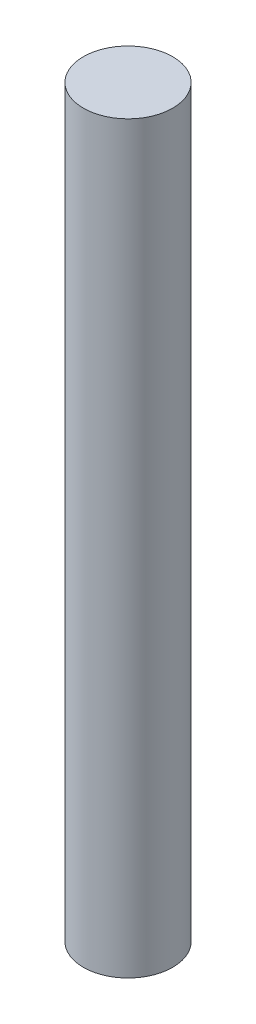
ISO-10303-21;
HEADER;
FILE_DESCRIPTION(('STEP AP214'),'2;1');
FILE_NAME('part.step','',(''),(''),'','','');
FILE_SCHEMA(('AUTOMOTIVE_DESIGN { 1 0 10303 214 1 1 1 1 }'));
ENDSEC;
DATA;
#1=APPLICATION_CONTEXT('core data for automotive mechanical design processes');
#2=APPLICATION_PROTOCOL_DEFINITION('international standard','automotive_design',2000,#1);
#3=PRODUCT_CONTEXT('',#1,'mechanical');
#4=PRODUCT('Part','Part','',(#3));
#5=PRODUCT_RELATED_PRODUCT_CATEGORY('part','',(#4));
#6=PRODUCT_DEFINITION_FORMATION('','',#4);
#7=PRODUCT_DEFINITION_CONTEXT('part definition',#1,'design');
#8=PRODUCT_DEFINITION('design','',#6,#7);
#9=PRODUCT_DEFINITION_SHAPE('','',#8);
#10=(LENGTH_UNIT() NAMED_UNIT(*) SI_UNIT(.MILLI.,.METRE.));
#11=(NAMED_UNIT(*) PLANE_ANGLE_UNIT() SI_UNIT($,.RADIAN.));
#12=(NAMED_UNIT(*) SI_UNIT($,.STERADIAN.) SOLID_ANGLE_UNIT());
#13=UNCERTAINTY_MEASURE_WITH_UNIT(LENGTH_MEASURE(1.E-05),#10,'distance_accuracy_value','');
#14=(GEOMETRIC_REPRESENTATION_CONTEXT(3) GLOBAL_UNCERTAINTY_ASSIGNED_CONTEXT((#13)) GLOBAL_UNIT_ASSIGNED_CONTEXT((#10,
#11,#12)) REPRESENTATION_CONTEXT('',''));
#15=CARTESIAN_POINT('',(0.,0.,0.));
#16=DIRECTION('',(0.,0.,1.));
#17=DIRECTION('',(1.,0.,0.));
#18=AXIS2_PLACEMENT_3D('',#15,#16,#17);
#19=CARTESIAN_POINT('',(413.25,-225.67,58.5));
#20=DIRECTION('',(0.,-1.,0.));
#21=DIRECTION('',(0.,0.,-1.));
#22=AXIS2_PLACEMENT_3D('',#19,#20,#21);
#23=PLANE('',#22);
#24=CARTESIAN_POINT('',(413.25,-225.67,58.5));
#25=DIRECTION('',(0.,-1.,0.));
#26=DIRECTION('',(0.,0.,1.));
#27=AXIS2_PLACEMENT_3D('',#24,#25,#26);
#28=CIRCLE('',#27,6.);
#29=CARTESIAN_POINT('',(413.25,-225.67,64.5));
#30=VERTEX_POINT('',#29);
#31=EDGE_CURVE('E10',#30,#30,#28,.T.);
#32=ORIENTED_EDGE('',*,*,#31,.T.);
#33=EDGE_LOOP('',(#32));
#34=FACE_BOUND('',#33,.T.);
#35=ADVANCED_FACE('F15',(#34),#23,.T.);
#36=CARTESIAN_POINT('',(413.25,-125.67,58.5));
#37=DIRECTION('',(0.,-1.,0.));
#38=DIRECTION('',(1.,0.,0.));
#39=AXIS2_PLACEMENT_3D('',#36,#37,#38);
#40=CYLINDRICAL_SURFACE('',#39,6.);
#41=CARTESIAN_POINT('',(413.25,-125.67,58.5));
#42=DIRECTION('',(0.,-1.,0.));
#43=DIRECTION('',(0.,0.,-1.));
#44=AXIS2_PLACEMENT_3D('',#41,#42,#43);
#45=CIRCLE('',#44,6.);
#46=CARTESIAN_POINT('',(413.25,-125.67,52.5));
#47=VERTEX_POINT('',#46);
#48=EDGE_CURVE('E22',#47,#47,#45,.F.);
#49=ORIENTED_EDGE('',*,*,#48,.F.);
#50=EDGE_LOOP('',(#49));
#51=FACE_BOUND('',#50,.T.);
#52=ORIENTED_EDGE('',*,*,#31,.F.);
#53=EDGE_LOOP('',(#52));
#54=FACE_BOUND('',#53,.T.);
#55=ADVANCED_FACE('F17',(#51,#54),#40,.T.);
#56=CARTESIAN_POINT('',(413.25,-125.67,58.5));
#57=DIRECTION('',(0.,-1.,0.));
#58=DIRECTION('',(0.,0.,-1.));
#59=AXIS2_PLACEMENT_3D('',#56,#57,#58);
#60=PLANE('',#59);
#61=ORIENTED_EDGE('',*,*,#48,.T.);
#62=EDGE_LOOP('',(#61));
#63=FACE_BOUND('',#62,.T.);
#64=ADVANCED_FACE('F28',(#63),#60,.F.);
#65=CLOSED_SHELL('',(#35,#55,#64));
#66=MANIFOLD_SOLID_BREP('B1',#65);
#67=ADVANCED_BREP_SHAPE_REPRESENTATION('',(#18,#66),#14);
#68=SHAPE_DEFINITION_REPRESENTATION(#9,#67);
ENDSEC;
END-ISO-10303-21;
